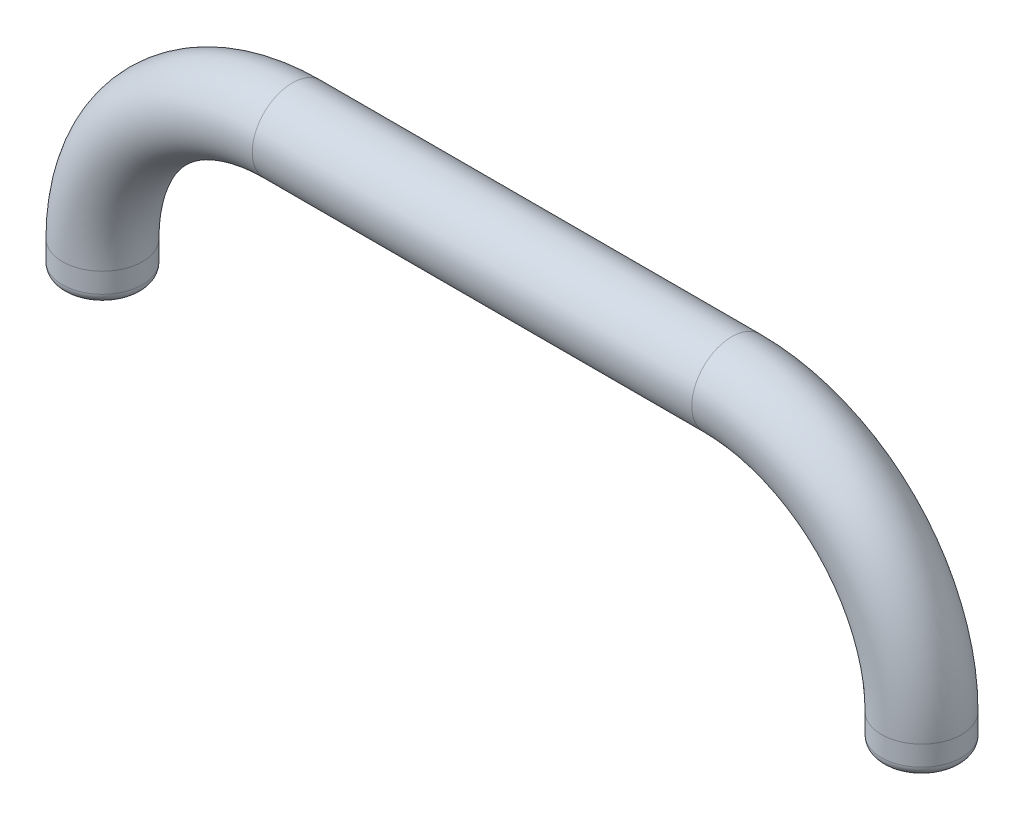
ISO-10303-21;
HEADER;
FILE_DESCRIPTION(('STEP AP214'),'2;1');
FILE_NAME('part.step','',(''),(''),'','','');
FILE_SCHEMA(('AUTOMOTIVE_DESIGN { 1 0 10303 214 1 1 1 1 }'));
ENDSEC;
DATA;
#1=APPLICATION_CONTEXT('core data for automotive mechanical design processes');
#2=APPLICATION_PROTOCOL_DEFINITION('international standard','automotive_design',2000,#1);
#3=PRODUCT_CONTEXT('',#1,'mechanical');
#4=PRODUCT('Part','Part','',(#3));
#5=PRODUCT_RELATED_PRODUCT_CATEGORY('part','',(#4));
#6=PRODUCT_DEFINITION_FORMATION('','',#4);
#7=PRODUCT_DEFINITION_CONTEXT('part definition',#1,'design');
#8=PRODUCT_DEFINITION('design','',#6,#7);
#9=PRODUCT_DEFINITION_SHAPE('','',#8);
#10=(LENGTH_UNIT() NAMED_UNIT(*) SI_UNIT(.MILLI.,.METRE.));
#11=(NAMED_UNIT(*) PLANE_ANGLE_UNIT() SI_UNIT($,.RADIAN.));
#12=(NAMED_UNIT(*) SI_UNIT($,.STERADIAN.) SOLID_ANGLE_UNIT());
#13=UNCERTAINTY_MEASURE_WITH_UNIT(LENGTH_MEASURE(1.E-05),#10,'distance_accuracy_value','');
#14=(GEOMETRIC_REPRESENTATION_CONTEXT(3) GLOBAL_UNCERTAINTY_ASSIGNED_CONTEXT((#13)) GLOBAL_UNIT_ASSIGNED_CONTEXT((#10,
#11,#12)) REPRESENTATION_CONTEXT('',''));
#15=CARTESIAN_POINT('',(0.,0.,0.));
#16=DIRECTION('',(0.,0.,1.));
#17=DIRECTION('',(1.,0.,0.));
#18=AXIS2_PLACEMENT_3D('',#15,#16,#17);
#19=CARTESIAN_POINT('',(-41.,-19.,0.));
#20=DIRECTION('',(0.,-1.,0.));
#21=DIRECTION('',(0.,0.,-1.));
#22=AXIS2_PLACEMENT_3D('',#19,#20,#21);
#23=CYLINDRICAL_SURFACE('',#22,4.);
#24=CARTESIAN_POINT('',(-41.,-21.,0.));
#25=DIRECTION('',(0.,1.,0.));
#26=DIRECTION('',(-1.,0.,0.));
#27=AXIS2_PLACEMENT_3D('',#24,#25,#26);
#28=CIRCLE('',#27,4.);
#29=CARTESIAN_POINT('',(-45.,-21.,0.));
#30=VERTEX_POINT('',#29);
#31=EDGE_CURVE('E37',#30,#30,#28,.T.);
#32=ORIENTED_EDGE('',*,*,#31,.T.);
#33=EDGE_LOOP('',(#32));
#34=FACE_BOUND('',#33,.T.);
#35=CARTESIAN_POINT('',(-41.,-19.,0.));
#36=DIRECTION('',(0.,1.,0.));
#37=DIRECTION('',(0.,0.,-1.));
#38=AXIS2_PLACEMENT_3D('',#35,#36,#37);
#39=CIRCLE('',#38,4.);
#40=CARTESIAN_POINT('',(-45.,-19.,0.));
#41=VERTEX_POINT('',#40);
#42=EDGE_CURVE('E50',#41,#41,#39,.T.);
#43=ORIENTED_EDGE('',*,*,#42,.F.);
#44=EDGE_LOOP('',(#43));
#45=FACE_BOUND('',#44,.T.);
#46=ADVANCED_FACE('F30',(#34,#45),#23,.T.);
#47=CARTESIAN_POINT('',(-22.,-19.,0.));
#48=DIRECTION('',(0.,0.,1.));
#49=DIRECTION('',(1.,0.,0.));
#50=AXIS2_PLACEMENT_3D('',#47,#48,#49);
#51=TOROIDAL_SURFACE('',#50,19.,4.);
#52=CARTESIAN_POINT('',(-22.,0.,0.));
#53=DIRECTION('',(1.,0.,0.));
#54=DIRECTION('',(0.,0.,-1.));
#55=AXIS2_PLACEMENT_3D('',#52,#53,#54);
#56=CIRCLE('',#55,4.);
#57=CARTESIAN_POINT('',(-22.,4.,0.));
#58=VERTEX_POINT('',#57);
#59=EDGE_CURVE('E53',#58,#58,#56,.T.);
#60=CARTESIAN_POINT('',(-22.,-19.,0.));
#61=DIRECTION('',(0.,0.,1.));
#62=DIRECTION('',(1.,0.,0.));
#63=AXIS2_PLACEMENT_3D('',#60,#61,#62);
#64=CIRCLE('',#63,23.);
#65=EDGE_CURVE('',#58,#41,#64,.T.);
#66=ORIENTED_EDGE('',*,*,#59,.F.);
#67=ORIENTED_EDGE('',*,*,#42,.T.);
#68=ORIENTED_EDGE('',*,*,#65,.T.);
#69=ORIENTED_EDGE('',*,*,#65,.F.);
#70=EDGE_LOOP('',(#66,#68,#67,#69));
#71=FACE_BOUND('',#70,.T.);
#72=ADVANCED_FACE('F74',(#71),#51,.T.);
#73=CARTESIAN_POINT('',(22.,0.,0.));
#74=DIRECTION('',(-1.,0.,0.));
#75=DIRECTION('',(0.,-1.,0.));
#76=AXIS2_PLACEMENT_3D('',#73,#74,#75);
#77=CYLINDRICAL_SURFACE('',#76,4.);
#78=CARTESIAN_POINT('',(22.,0.,0.));
#79=DIRECTION('',(1.,0.,0.));
#80=DIRECTION('',(0.,0.,-1.));
#81=AXIS2_PLACEMENT_3D('',#78,#79,#80);
#82=CIRCLE('',#81,4.);
#83=CARTESIAN_POINT('',(22.,4.,0.));
#84=VERTEX_POINT('',#83);
#85=EDGE_CURVE('E56',#84,#84,#82,.T.);
#86=ORIENTED_EDGE('',*,*,#85,.F.);
#87=EDGE_LOOP('',(#86));
#88=FACE_BOUND('',#87,.T.);
#89=ORIENTED_EDGE('',*,*,#59,.T.);
#90=EDGE_LOOP('',(#89));
#91=FACE_BOUND('',#90,.T.);
#92=ADVANCED_FACE('F68',(#88,#91),#77,.T.);
#93=CARTESIAN_POINT('',(22.,-19.,0.));
#94=DIRECTION('',(0.,0.,1.));
#95=DIRECTION('',(1.,0.,0.));
#96=AXIS2_PLACEMENT_3D('',#93,#94,#95);
#97=TOROIDAL_SURFACE('',#96,19.,4.);
#98=CARTESIAN_POINT('',(41.,-19.,0.));
#99=DIRECTION('',(0.,-1.,0.));
#100=DIRECTION('',(0.,0.,-1.));
#101=AXIS2_PLACEMENT_3D('',#98,#99,#100);
#102=CIRCLE('',#101,4.);
#103=CARTESIAN_POINT('',(45.,-19.,0.));
#104=VERTEX_POINT('',#103);
#105=EDGE_CURVE('E59',#104,#104,#102,.T.);
#106=CARTESIAN_POINT('',(22.,-19.,0.));
#107=DIRECTION('',(0.,0.,1.));
#108=DIRECTION('',(1.,0.,0.));
#109=AXIS2_PLACEMENT_3D('',#106,#107,#108);
#110=CIRCLE('',#109,23.);
#111=EDGE_CURVE('',#104,#84,#110,.T.);
#112=ORIENTED_EDGE('',*,*,#105,.F.);
#113=ORIENTED_EDGE('',*,*,#85,.T.);
#114=ORIENTED_EDGE('',*,*,#111,.T.);
#115=ORIENTED_EDGE('',*,*,#111,.F.);
#116=EDGE_LOOP('',(#112,#114,#113,#115));
#117=FACE_BOUND('',#116,.T.);
#118=ADVANCED_FACE('F65',(#117),#97,.T.);
#119=CARTESIAN_POINT('',(41.,-19.,0.));
#120=DIRECTION('',(0.,-1.,0.));
#121=DIRECTION('',(0.,0.,-1.));
#122=AXIS2_PLACEMENT_3D('',#119,#120,#121);
#123=CYLINDRICAL_SURFACE('',#122,4.);
#124=CARTESIAN_POINT('',(41.,-21.,0.));
#125=DIRECTION('',(0.,-1.,0.));
#126=DIRECTION('',(0.,0.,-1.));
#127=AXIS2_PLACEMENT_3D('',#124,#125,#126);
#128=CIRCLE('',#127,4.);
#129=CARTESIAN_POINT('',(41.,-21.,-4.));
#130=VERTEX_POINT('',#129);
#131=EDGE_CURVE('E41',#130,#130,#128,.F.);
#132=ORIENTED_EDGE('',*,*,#131,.T.);
#133=EDGE_LOOP('',(#132));
#134=FACE_BOUND('',#133,.T.);
#135=ORIENTED_EDGE('',*,*,#105,.T.);
#136=EDGE_LOOP('',(#135));
#137=FACE_BOUND('',#136,.T.);
#138=ADVANCED_FACE('F63',(#134,#137),#123,.T.);
#139=CARTESIAN_POINT('',(-41.,-22.,0.));
#140=DIRECTION('',(0.,1.,0.));
#141=DIRECTION('',(0.,0.,-1.));
#142=AXIS2_PLACEMENT_3D('',#139,#140,#141);
#143=PLANE('',#142);
#144=CARTESIAN_POINT('',(-41.,-22.,0.));
#145=DIRECTION('',(0.,1.,0.));
#146=DIRECTION('',(-1.,0.,0.));
#147=AXIS2_PLACEMENT_3D('',#144,#145,#146);
#148=CIRCLE('',#147,3.);
#149=CARTESIAN_POINT('',(-44.,-22.,0.));
#150=VERTEX_POINT('',#149);
#151=EDGE_CURVE('E10',#150,#150,#148,.F.);
#152=ORIENTED_EDGE('',*,*,#151,.T.);
#153=EDGE_LOOP('',(#152));
#154=FACE_BOUND('',#153,.T.);
#155=ADVANCED_FACE('F96',(#154),#143,.F.);
#156=CARTESIAN_POINT('',(41.,-22.,0.));
#157=DIRECTION('',(0.,-1.,0.));
#158=DIRECTION('',(0.,0.,-1.));
#159=AXIS2_PLACEMENT_3D('',#156,#157,#158);
#160=PLANE('',#159);
#161=CARTESIAN_POINT('',(41.,-22.,0.));
#162=DIRECTION('',(0.,-1.,0.));
#163=DIRECTION('',(0.,0.,-1.));
#164=AXIS2_PLACEMENT_3D('',#161,#162,#163);
#165=CIRCLE('',#164,3.);
#166=CARTESIAN_POINT('',(41.,-22.,-3.));
#167=VERTEX_POINT('',#166);
#168=EDGE_CURVE('E45',#167,#167,#165,.T.);
#169=ORIENTED_EDGE('',*,*,#168,.T.);
#170=EDGE_LOOP('',(#169));
#171=FACE_BOUND('',#170,.T.);
#172=ADVANCED_FACE('F89',(#171),#160,.T.);
#173=CARTESIAN_POINT('',(41.,-21.,0.));
#174=DIRECTION('',(0.,-1.,0.));
#175=DIRECTION('',(0.,0.,-1.));
#176=AXIS2_PLACEMENT_3D('',#173,#174,#175);
#177=TOROIDAL_SURFACE('',#176,3.,1.);
#178=ORIENTED_EDGE('',*,*,#131,.F.);
#179=EDGE_LOOP('',(#178));
#180=FACE_BOUND('',#179,.T.);
#181=ORIENTED_EDGE('',*,*,#168,.F.);
#182=EDGE_LOOP('',(#181));
#183=FACE_BOUND('',#182,.T.);
#184=ADVANCED_FACE('F87',(#180,#183),#177,.T.);
#185=CARTESIAN_POINT('',(-41.,-21.,0.));
#186=DIRECTION('',(0.,1.,0.));
#187=DIRECTION('',(-1.,0.,0.));
#188=AXIS2_PLACEMENT_3D('',#185,#186,#187);
#189=TOROIDAL_SURFACE('',#188,3.,1.);
#190=ORIENTED_EDGE('',*,*,#151,.F.);
#191=EDGE_LOOP('',(#190));
#192=FACE_BOUND('',#191,.T.);
#193=ORIENTED_EDGE('',*,*,#31,.F.);
#194=EDGE_LOOP('',(#193));
#195=FACE_BOUND('',#194,.T.);
#196=ADVANCED_FACE('F32',(#192,#195),#189,.T.);
#197=CLOSED_SHELL('',(#46,#72,#92,#118,#138,#155,#172,#184,#196));
#198=MANIFOLD_SOLID_BREP('B2',#197);
#199=ADVANCED_BREP_SHAPE_REPRESENTATION('',(#18,#198),#14);
#200=SHAPE_DEFINITION_REPRESENTATION(#9,#199);
ENDSEC;
END-ISO-10303-21;
